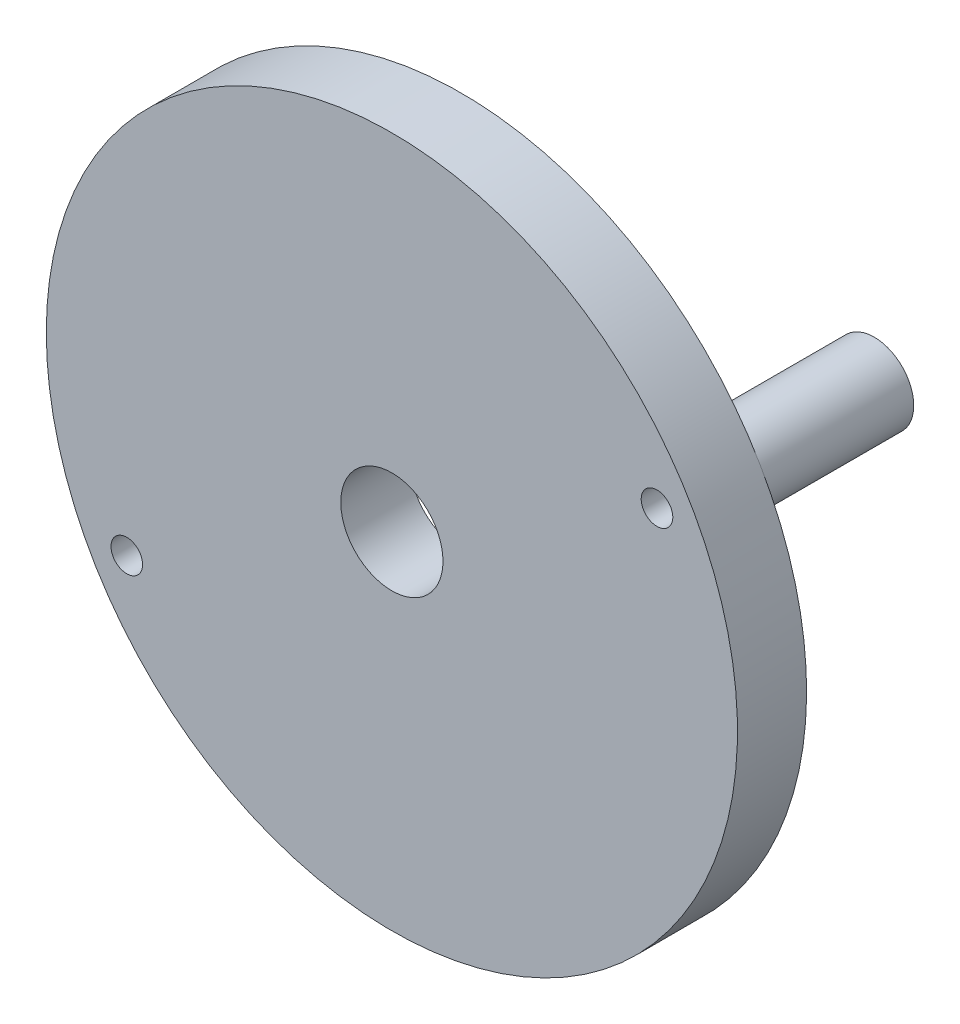
ISO-10303-21;
HEADER;
FILE_DESCRIPTION(('STEP AP214'),'2;1');
FILE_NAME('part.step','',(''),(''),'','','');
FILE_SCHEMA(('AUTOMOTIVE_DESIGN { 1 0 10303 214 1 1 1 1 }'));
ENDSEC;
DATA;
#1=APPLICATION_CONTEXT('core data for automotive mechanical design processes');
#2=APPLICATION_PROTOCOL_DEFINITION('international standard','automotive_design',2000,#1);
#3=PRODUCT_CONTEXT('',#1,'mechanical');
#4=PRODUCT('Part','Part','',(#3));
#5=PRODUCT_RELATED_PRODUCT_CATEGORY('part','',(#4));
#6=PRODUCT_DEFINITION_FORMATION('','',#4);
#7=PRODUCT_DEFINITION_CONTEXT('part definition',#1,'design');
#8=PRODUCT_DEFINITION('design','',#6,#7);
#9=PRODUCT_DEFINITION_SHAPE('','',#8);
#10=(LENGTH_UNIT() NAMED_UNIT(*) SI_UNIT(.MILLI.,.METRE.));
#11=(NAMED_UNIT(*) PLANE_ANGLE_UNIT() SI_UNIT($,.RADIAN.));
#12=(NAMED_UNIT(*) SI_UNIT($,.STERADIAN.) SOLID_ANGLE_UNIT());
#13=UNCERTAINTY_MEASURE_WITH_UNIT(LENGTH_MEASURE(1.E-05),#10,'distance_accuracy_value','');
#14=(GEOMETRIC_REPRESENTATION_CONTEXT(3) GLOBAL_UNCERTAINTY_ASSIGNED_CONTEXT((#13)) GLOBAL_UNIT_ASSIGNED_CONTEXT((#10,
#11,#12)) REPRESENTATION_CONTEXT('',''));
#15=CARTESIAN_POINT('',(0.,0.,0.));
#16=DIRECTION('',(0.,0.,1.));
#17=DIRECTION('',(1.,0.,0.));
#18=AXIS2_PLACEMENT_3D('',#15,#16,#17);
#19=CARTESIAN_POINT('',(-13.4233937586589,-7.74999999999992,-7.5));
#20=DIRECTION('',(0.,0.,1.));
#21=DIRECTION('',(1.,0.,0.));
#22=AXIS2_PLACEMENT_3D('',#19,#20,#21);
#23=CYLINDRICAL_SURFACE('',#22,2.);
#24=CARTESIAN_POINT('',(-13.4233937586589,-7.74999999999992,-7.5));
#25=DIRECTION('',(0.,0.,1.));
#26=DIRECTION('',(1.,0.,0.));
#27=AXIS2_PLACEMENT_3D('',#24,#25,#26);
#28=CIRCLE('',#27,2.);
#29=CARTESIAN_POINT('',(-11.4233937586589,-7.74999999999992,-7.5));
#30=VERTEX_POINT('',#29);
#31=EDGE_CURVE('E52',#30,#30,#28,.F.);
#32=ORIENTED_EDGE('',*,*,#31,.F.);
#33=EDGE_LOOP('',(#32));
#34=FACE_BOUND('',#33,.T.);
#35=CARTESIAN_POINT('',(-13.4233937586589,-7.74999999999992,0.));
#36=DIRECTION('',(0.,0.,1.));
#37=DIRECTION('',(1.,0.,0.));
#38=AXIS2_PLACEMENT_3D('',#35,#36,#37);
#39=CIRCLE('',#38,2.);
#40=CARTESIAN_POINT('',(-11.4233937586589,-7.74999999999992,0.));
#41=VERTEX_POINT('',#40);
#42=EDGE_CURVE('E50',#41,#41,#39,.F.);
#43=ORIENTED_EDGE('',*,*,#42,.T.);
#44=EDGE_LOOP('',(#43));
#45=FACE_BOUND('',#44,.T.);
#46=ADVANCED_FACE('F15',(#34,#45),#23,.T.);
#47=CARTESIAN_POINT('',(13.4233937586588,7.74999999999992,-7.5));
#48=DIRECTION('',(0.,0.,1.));
#49=DIRECTION('',(1.,0.,0.));
#50=AXIS2_PLACEMENT_3D('',#47,#48,#49);
#51=CYLINDRICAL_SURFACE('',#50,1.99999999999999);
#52=CARTESIAN_POINT('',(13.4233937586588,7.74999999999992,0.));
#53=DIRECTION('',(0.,0.,1.));
#54=DIRECTION('',(1.,0.,0.));
#55=AXIS2_PLACEMENT_3D('',#52,#53,#54);
#56=CIRCLE('',#55,1.99999999999999);
#57=CARTESIAN_POINT('',(15.4233937586588,7.74999999999992,0.));
#58=VERTEX_POINT('',#57);
#59=EDGE_CURVE('E47',#58,#58,#56,.F.);
#60=ORIENTED_EDGE('',*,*,#59,.T.);
#61=EDGE_LOOP('',(#60));
#62=FACE_BOUND('',#61,.T.);
#63=CARTESIAN_POINT('',(13.4233937586588,7.74999999999992,-7.5));
#64=DIRECTION('',(0.,0.,1.));
#65=DIRECTION('',(1.,0.,0.));
#66=AXIS2_PLACEMENT_3D('',#63,#64,#65);
#67=CIRCLE('',#66,1.99999999999999);
#68=CARTESIAN_POINT('',(15.4233937586588,7.74999999999992,-7.5));
#69=VERTEX_POINT('',#68);
#70=EDGE_CURVE('E18',#69,#69,#67,.F.);
#71=ORIENTED_EDGE('',*,*,#70,.F.);
#72=EDGE_LOOP('',(#71));
#73=FACE_BOUND('',#72,.T.);
#74=ADVANCED_FACE('F62',(#62,#73),#51,.T.);
#75=CARTESIAN_POINT('',(13.4233937586588,7.74999999999992,-7.5));
#76=DIRECTION('',(0.,0.,-1.));
#77=DIRECTION('',(-1.,0.,0.));
#78=AXIS2_PLACEMENT_3D('',#75,#76,#77);
#79=PLANE('',#78);
#80=ORIENTED_EDGE('',*,*,#70,.T.);
#81=EDGE_LOOP('',(#80));
#82=FACE_BOUND('',#81,.T.);
#83=CARTESIAN_POINT('',(13.4233937586588,7.74999999999992,-7.5));
#84=DIRECTION('',(0.,0.,-1.));
#85=DIRECTION('',(-1.,0.,0.));
#86=AXIS2_PLACEMENT_3D('',#83,#84,#85);
#87=CIRCLE('',#86,0.799999999999997);
#88=CARTESIAN_POINT('',(12.6233937586589,7.74999999999992,-7.5));
#89=VERTEX_POINT('',#88);
#90=EDGE_CURVE('E44',#89,#89,#87,.F.);
#91=ORIENTED_EDGE('',*,*,#90,.T.);
#92=EDGE_LOOP('',(#91));
#93=FACE_BOUND('',#92,.T.);
#94=ADVANCED_FACE('F59',(#82,#93),#79,.T.);
#95=CARTESIAN_POINT('',(-13.4233937586589,-7.74999999999992,-7.5));
#96=DIRECTION('',(0.,0.,-1.));
#97=DIRECTION('',(-1.,0.,0.));
#98=AXIS2_PLACEMENT_3D('',#95,#96,#97);
#99=PLANE('',#98);
#100=ORIENTED_EDGE('',*,*,#31,.T.);
#101=EDGE_LOOP('',(#100));
#102=FACE_BOUND('',#101,.T.);
#103=CARTESIAN_POINT('',(-13.4233937586589,-7.74999999999992,-7.5));
#104=DIRECTION('',(0.,0.,-1.));
#105=DIRECTION('',(-1.,0.,0.));
#106=AXIS2_PLACEMENT_3D('',#103,#104,#105);
#107=CIRCLE('',#106,0.799999999999999);
#108=CARTESIAN_POINT('',(-14.2233937586589,-7.74999999999992,-7.5));
#109=VERTEX_POINT('',#108);
#110=EDGE_CURVE('E41',#109,#109,#107,.F.);
#111=ORIENTED_EDGE('',*,*,#110,.T.);
#112=EDGE_LOOP('',(#111));
#113=FACE_BOUND('',#112,.T.);
#114=ADVANCED_FACE('F70',(#102,#113),#99,.T.);
#115=CARTESIAN_POINT('',(0.,0.,0.));
#116=DIRECTION('',(0.,0.,1.));
#117=DIRECTION('',(1.,0.,0.));
#118=AXIS2_PLACEMENT_3D('',#115,#116,#117);
#119=PLANE('',#118);
#120=ORIENTED_EDGE('',*,*,#59,.F.);
#121=EDGE_LOOP('',(#120));
#122=FACE_BOUND('',#121,.T.);
#123=ORIENTED_EDGE('',*,*,#42,.F.);
#124=EDGE_LOOP('',(#123));
#125=FACE_BOUND('',#124,.T.);
#126=CARTESIAN_POINT('',(0.,0.,0.));
#127=DIRECTION('',(0.,0.,-1.));
#128=DIRECTION('',(-1.,0.,0.));
#129=AXIS2_PLACEMENT_3D('',#126,#127,#128);
#130=CIRCLE('',#129,17.5);
#131=CARTESIAN_POINT('',(-17.5,0.,0.));
#132=VERTEX_POINT('',#131);
#133=EDGE_CURVE('E35',#132,#132,#130,.F.);
#134=ORIENTED_EDGE('',*,*,#133,.F.);
#135=EDGE_LOOP('',(#134));
#136=FACE_BOUND('',#135,.T.);
#137=CARTESIAN_POINT('',(0.,0.,0.));
#138=DIRECTION('',(0.,0.,-1.));
#139=DIRECTION('',(-1.,0.,0.));
#140=AXIS2_PLACEMENT_3D('',#137,#138,#139);
#141=CIRCLE('',#140,2.5875);
#142=CARTESIAN_POINT('',(-2.5875,0.,0.));
#143=VERTEX_POINT('',#142);
#144=EDGE_CURVE('E38',#143,#143,#141,.F.);
#145=ORIENTED_EDGE('',*,*,#144,.T.);
#146=EDGE_LOOP('',(#145));
#147=FACE_BOUND('',#146,.T.);
#148=ADVANCED_FACE('F95',(#122,#125,#136,#147),#119,.F.);
#149=CARTESIAN_POINT('',(13.4233937586588,7.74999999999992,-7.5));
#150=DIRECTION('',(0.,0.,-1.));
#151=DIRECTION('',(-1.,0.,0.));
#152=AXIS2_PLACEMENT_3D('',#149,#150,#151);
#153=CYLINDRICAL_SURFACE('',#152,0.799999999999997);
#154=ORIENTED_EDGE('',*,*,#90,.F.);
#155=EDGE_LOOP('',(#154));
#156=FACE_BOUND('',#155,.T.);
#157=CARTESIAN_POINT('',(13.4233937586588,7.74999999999992,3.5));
#158=DIRECTION('',(0.,0.,-1.));
#159=DIRECTION('',(-1.,0.,0.));
#160=AXIS2_PLACEMENT_3D('',#157,#158,#159);
#161=CIRCLE('',#160,0.799999999999997);
#162=CARTESIAN_POINT('',(12.6233937586589,7.74999999999992,3.5));
#163=VERTEX_POINT('',#162);
#164=EDGE_CURVE('E32',#163,#163,#161,.T.);
#165=ORIENTED_EDGE('',*,*,#164,.F.);
#166=EDGE_LOOP('',(#165));
#167=FACE_BOUND('',#166,.T.);
#168=ADVANCED_FACE('F91',(#156,#167),#153,.F.);
#169=CARTESIAN_POINT('',(-13.4233937586589,-7.74999999999992,-7.5));
#170=DIRECTION('',(0.,0.,-1.));
#171=DIRECTION('',(-1.,0.,0.));
#172=AXIS2_PLACEMENT_3D('',#169,#170,#171);
#173=CYLINDRICAL_SURFACE('',#172,0.799999999999999);
#174=ORIENTED_EDGE('',*,*,#110,.F.);
#175=EDGE_LOOP('',(#174));
#176=FACE_BOUND('',#175,.T.);
#177=CARTESIAN_POINT('',(-13.4233937586589,-7.74999999999992,3.5));
#178=DIRECTION('',(0.,0.,-1.));
#179=DIRECTION('',(-1.,0.,0.));
#180=AXIS2_PLACEMENT_3D('',#177,#178,#179);
#181=CIRCLE('',#180,0.799999999999999);
#182=CARTESIAN_POINT('',(-14.2233937586589,-7.74999999999992,3.5));
#183=VERTEX_POINT('',#182);
#184=EDGE_CURVE('E27',#183,#183,#181,.T.);
#185=ORIENTED_EDGE('',*,*,#184,.F.);
#186=EDGE_LOOP('',(#185));
#187=FACE_BOUND('',#186,.T.);
#188=ADVANCED_FACE('F87',(#176,#187),#173,.F.);
#189=CARTESIAN_POINT('',(0.,0.,3.5));
#190=DIRECTION('',(0.,0.,-1.));
#191=DIRECTION('',(-1.,0.,0.));
#192=AXIS2_PLACEMENT_3D('',#189,#190,#191);
#193=CYLINDRICAL_SURFACE('',#192,2.5875);
#194=CARTESIAN_POINT('',(0.,0.,3.5));
#195=DIRECTION('',(0.,0.,-1.));
#196=DIRECTION('',(-1.,0.,0.));
#197=AXIS2_PLACEMENT_3D('',#194,#195,#196);
#198=CIRCLE('',#197,2.5875);
#199=CARTESIAN_POINT('',(-2.5875,0.,3.5));
#200=VERTEX_POINT('',#199);
#201=EDGE_CURVE('E22',#200,#200,#198,.T.);
#202=ORIENTED_EDGE('',*,*,#201,.F.);
#203=EDGE_LOOP('',(#202));
#204=FACE_BOUND('',#203,.T.);
#205=ORIENTED_EDGE('',*,*,#144,.F.);
#206=EDGE_LOOP('',(#205));
#207=FACE_BOUND('',#206,.T.);
#208=ADVANCED_FACE('F80',(#204,#207),#193,.F.);
#209=CARTESIAN_POINT('',(0.,0.,3.5));
#210=DIRECTION('',(0.,0.,-1.));
#211=DIRECTION('',(-1.,0.,0.));
#212=AXIS2_PLACEMENT_3D('',#209,#210,#211);
#213=CYLINDRICAL_SURFACE('',#212,17.5);
#214=ORIENTED_EDGE('',*,*,#133,.T.);
#215=EDGE_LOOP('',(#214));
#216=FACE_BOUND('',#215,.T.);
#217=CARTESIAN_POINT('',(0.,0.,3.5));
#218=DIRECTION('',(0.,0.,-1.));
#219=DIRECTION('',(-1.,0.,0.));
#220=AXIS2_PLACEMENT_3D('',#217,#218,#219);
#221=CIRCLE('',#220,17.5);
#222=CARTESIAN_POINT('',(-17.5,0.,3.5));
#223=VERTEX_POINT('',#222);
#224=EDGE_CURVE('E10',#223,#223,#221,.F.);
#225=ORIENTED_EDGE('',*,*,#224,.F.);
#226=EDGE_LOOP('',(#225));
#227=FACE_BOUND('',#226,.T.);
#228=ADVANCED_FACE('F75',(#216,#227),#213,.T.);
#229=CARTESIAN_POINT('',(0.,0.,3.5));
#230=DIRECTION('',(0.,0.,1.));
#231=DIRECTION('',(1.,0.,0.));
#232=AXIS2_PLACEMENT_3D('',#229,#230,#231);
#233=PLANE('',#232);
#234=ORIENTED_EDGE('',*,*,#224,.T.);
#235=EDGE_LOOP('',(#234));
#236=FACE_BOUND('',#235,.T.);
#237=ORIENTED_EDGE('',*,*,#201,.T.);
#238=EDGE_LOOP('',(#237));
#239=FACE_BOUND('',#238,.T.);
#240=ORIENTED_EDGE('',*,*,#184,.T.);
#241=EDGE_LOOP('',(#240));
#242=FACE_BOUND('',#241,.T.);
#243=ORIENTED_EDGE('',*,*,#164,.T.);
#244=EDGE_LOOP('',(#243));
#245=FACE_BOUND('',#244,.T.);
#246=ADVANCED_FACE('F73',(#236,#239,#242,#245),#233,.T.);
#247=CLOSED_SHELL('',(#46,#74,#94,#114,#148,#168,#188,#208,#228,#246));
#248=MANIFOLD_SOLID_BREP('B1',#247);
#249=ADVANCED_BREP_SHAPE_REPRESENTATION('',(#18,#248),#14);
#250=SHAPE_DEFINITION_REPRESENTATION(#9,#249);
ENDSEC;
END-ISO-10303-21;
